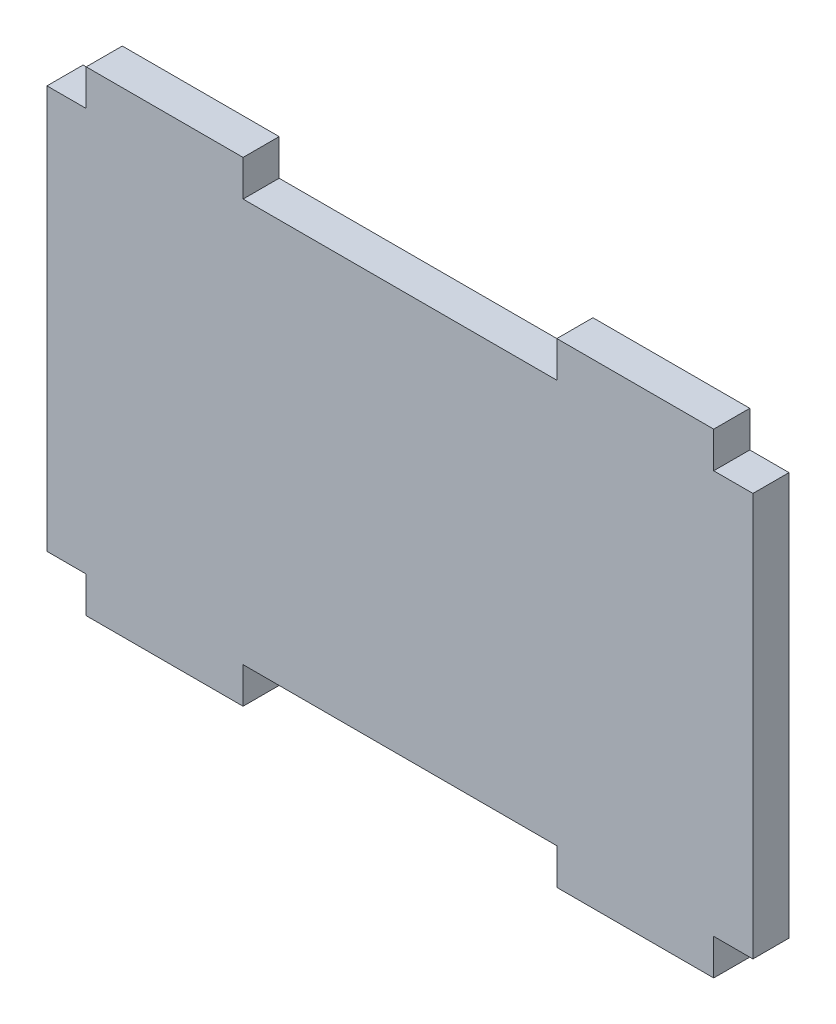
ISO-10303-21;
HEADER;
FILE_DESCRIPTION(('STEP AP214'),'2;1');
FILE_NAME('part.step','',(''),(''),'','','');
FILE_SCHEMA(('AUTOMOTIVE_DESIGN { 1 0 10303 214 1 1 1 1 }'));
ENDSEC;
DATA;
#1=APPLICATION_CONTEXT('core data for automotive mechanical design processes');
#2=APPLICATION_PROTOCOL_DEFINITION('international standard','automotive_design',2000,#1);
#3=PRODUCT_CONTEXT('',#1,'mechanical');
#4=PRODUCT('Part','Part','',(#3));
#5=PRODUCT_RELATED_PRODUCT_CATEGORY('part','',(#4));
#6=PRODUCT_DEFINITION_FORMATION('','',#4);
#7=PRODUCT_DEFINITION_CONTEXT('part definition',#1,'design');
#8=PRODUCT_DEFINITION('design','',#6,#7);
#9=PRODUCT_DEFINITION_SHAPE('','',#8);
#10=(LENGTH_UNIT() NAMED_UNIT(*) SI_UNIT(.MILLI.,.METRE.));
#11=(NAMED_UNIT(*) PLANE_ANGLE_UNIT() SI_UNIT($,.RADIAN.));
#12=(NAMED_UNIT(*) SI_UNIT($,.STERADIAN.) SOLID_ANGLE_UNIT());
#13=UNCERTAINTY_MEASURE_WITH_UNIT(LENGTH_MEASURE(1.E-05),#10,'distance_accuracy_value','');
#14=(GEOMETRIC_REPRESENTATION_CONTEXT(3) GLOBAL_UNCERTAINTY_ASSIGNED_CONTEXT((#13)) GLOBAL_UNIT_ASSIGNED_CONTEXT((#10,
#11,#12)) REPRESENTATION_CONTEXT('',''));
#15=CARTESIAN_POINT('',(0.,0.,0.));
#16=DIRECTION('',(0.,0.,1.));
#17=DIRECTION('',(1.,0.,0.));
#18=AXIS2_PLACEMENT_3D('',#15,#16,#17);
#19=CARTESIAN_POINT('',(2.5,2.3,0.6972));
#20=DIRECTION('',(0.,-1.,0.));
#21=DIRECTION('',(0.,0.,-1.));
#22=AXIS2_PLACEMENT_3D('',#19,#20,#21);
#23=PLANE('',#22);
#24=DIRECTION('',(1.,0.,0.));
#25=VECTOR('',#24,1.);
#26=CARTESIAN_POINT('',(2.5,2.3,2.9972));
#27=LINE('',#26,#25);
#28=CARTESIAN_POINT('',(0.,2.3,2.9972));
#29=VERTEX_POINT('',#28);
#30=CARTESIAN_POINT('',(2.5,2.3,2.9972));
#31=VERTEX_POINT('',#30);
#32=EDGE_CURVE('E202',#29,#31,#27,.T.);
#33=ORIENTED_EDGE('',*,*,#32,.F.);
#34=DIRECTION('',(0.,0.,1.));
#35=VECTOR('',#34,1.);
#36=CARTESIAN_POINT('',(0.,2.3,0.6972));
#37=LINE('',#36,#35);
#38=CARTESIAN_POINT('',(0.,2.3,0.6972));
#39=VERTEX_POINT('',#38);
#40=EDGE_CURVE('E11',#39,#29,#37,.T.);
#41=ORIENTED_EDGE('',*,*,#40,.F.);
#42=DIRECTION('',(1.,0.,0.));
#43=VECTOR('',#42,1.);
#44=CARTESIAN_POINT('',(2.5,2.3,0.6972));
#45=LINE('',#44,#43);
#46=CARTESIAN_POINT('',(2.5,2.3,0.6972));
#47=VERTEX_POINT('',#46);
#48=EDGE_CURVE('E258',#39,#47,#45,.T.);
#49=ORIENTED_EDGE('',*,*,#48,.T.);
#50=DIRECTION('',(0.,0.,1.));
#51=VECTOR('',#50,1.);
#52=CARTESIAN_POINT('',(2.5,2.3,0.6972));
#53=LINE('',#52,#51);
#54=EDGE_CURVE('E36',#47,#31,#53,.T.);
#55=ORIENTED_EDGE('',*,*,#54,.T.);
#56=EDGE_LOOP('',(#33,#41,#49,#55));
#57=FACE_BOUND('',#56,.T.);
#58=ADVANCED_FACE('F33',(#57),#23,.T.);
#59=CARTESIAN_POINT('',(0.,2.3,0.6972));
#60=DIRECTION('',(-1.,0.,0.));
#61=DIRECTION('',(0.,0.,1.));
#62=AXIS2_PLACEMENT_3D('',#59,#60,#61);
#63=PLANE('',#62);
#64=DIRECTION('',(0.,-1.,0.));
#65=VECTOR('',#64,1.);
#66=CARTESIAN_POINT('',(0.,2.3,2.9972));
#67=LINE('',#66,#65);
#68=CARTESIAN_POINT('',(0.,28.,2.9972));
#69=VERTEX_POINT('',#68);
#70=EDGE_CURVE('E256',#69,#29,#67,.T.);
#71=ORIENTED_EDGE('',*,*,#70,.F.);
#72=DIRECTION('',(0.,0.,1.));
#73=VECTOR('',#72,1.);
#74=CARTESIAN_POINT('',(0.,28.,0.6972));
#75=LINE('',#74,#73);
#76=CARTESIAN_POINT('',(0.,28.,0.6972));
#77=VERTEX_POINT('',#76);
#78=EDGE_CURVE('E42',#77,#69,#75,.T.);
#79=ORIENTED_EDGE('',*,*,#78,.F.);
#80=DIRECTION('',(0.,-1.,0.));
#81=VECTOR('',#80,1.);
#82=CARTESIAN_POINT('',(0.,2.3,0.6972));
#83=LINE('',#82,#81);
#84=EDGE_CURVE('E192',#77,#39,#83,.T.);
#85=ORIENTED_EDGE('',*,*,#84,.T.);
#86=ORIENTED_EDGE('',*,*,#40,.T.);
#87=EDGE_LOOP('',(#71,#79,#85,#86));
#88=FACE_BOUND('',#87,.T.);
#89=ADVANCED_FACE('F295',(#88),#63,.T.);
#90=CARTESIAN_POINT('',(0.,28.,0.6972));
#91=DIRECTION('',(0.,1.,0.));
#92=DIRECTION('',(0.,0.,1.));
#93=AXIS2_PLACEMENT_3D('',#90,#91,#92);
#94=PLANE('',#93);
#95=DIRECTION('',(-1.,0.,0.));
#96=VECTOR('',#95,1.);
#97=CARTESIAN_POINT('',(0.,28.,2.9972));
#98=LINE('',#97,#96);
#99=CARTESIAN_POINT('',(2.5,28.,2.9972));
#100=VERTEX_POINT('',#99);
#101=EDGE_CURVE('E179',#100,#69,#98,.T.);
#102=ORIENTED_EDGE('',*,*,#101,.F.);
#103=DIRECTION('',(0.,0.,1.));
#104=VECTOR('',#103,1.);
#105=CARTESIAN_POINT('',(2.5,28.,0.6972));
#106=LINE('',#105,#104);
#107=CARTESIAN_POINT('',(2.5,28.,0.6972));
#108=VERTEX_POINT('',#107);
#109=EDGE_CURVE('E174',#108,#100,#106,.T.);
#110=ORIENTED_EDGE('',*,*,#109,.F.);
#111=DIRECTION('',(-1.,0.,0.));
#112=VECTOR('',#111,1.);
#113=CARTESIAN_POINT('',(0.,28.,0.6972));
#114=LINE('',#113,#112);
#115=EDGE_CURVE('E177',#108,#77,#114,.T.);
#116=ORIENTED_EDGE('',*,*,#115,.T.);
#117=ORIENTED_EDGE('',*,*,#78,.T.);
#118=EDGE_LOOP('',(#102,#110,#116,#117));
#119=FACE_BOUND('',#118,.T.);
#120=ADVANCED_FACE('F176',(#119),#94,.T.);
#121=CARTESIAN_POINT('',(2.5,28.,0.6972));
#122=DIRECTION('',(-1.,0.,0.));
#123=DIRECTION('',(0.,-1.,0.));
#124=AXIS2_PLACEMENT_3D('',#121,#122,#123);
#125=PLANE('',#124);
#126=DIRECTION('',(0.,-1.,0.));
#127=VECTOR('',#126,1.);
#128=CARTESIAN_POINT('',(2.5,28.,2.9972));
#129=LINE('',#128,#127);
#130=CARTESIAN_POINT('',(2.5,30.3,2.9972));
#131=VERTEX_POINT('',#130);
#132=EDGE_CURVE('E253',#131,#100,#129,.T.);
#133=ORIENTED_EDGE('',*,*,#132,.F.);
#134=DIRECTION('',(0.,0.,1.));
#135=VECTOR('',#134,1.);
#136=CARTESIAN_POINT('',(2.5,30.3,0.6972));
#137=LINE('',#136,#135);
#138=CARTESIAN_POINT('',(2.5,30.3,0.6972));
#139=VERTEX_POINT('',#138);
#140=EDGE_CURVE('E184',#139,#131,#137,.T.);
#141=ORIENTED_EDGE('',*,*,#140,.F.);
#142=DIRECTION('',(0.,-1.,0.));
#143=VECTOR('',#142,1.);
#144=CARTESIAN_POINT('',(2.5,28.,0.6972));
#145=LINE('',#144,#143);
#146=EDGE_CURVE('E190',#139,#108,#145,.T.);
#147=ORIENTED_EDGE('',*,*,#146,.T.);
#148=ORIENTED_EDGE('',*,*,#109,.T.);
#149=EDGE_LOOP('',(#133,#141,#147,#148));
#150=FACE_BOUND('',#149,.T.);
#151=ADVANCED_FACE('F194',(#150),#125,.T.);
#152=CARTESIAN_POINT('',(2.5,30.3,0.6972));
#153=DIRECTION('',(0.,1.,0.));
#154=DIRECTION('',(-1.,0.,0.));
#155=AXIS2_PLACEMENT_3D('',#152,#153,#154);
#156=PLANE('',#155);
#157=DIRECTION('',(-1.,0.,0.));
#158=VECTOR('',#157,1.);
#159=CARTESIAN_POINT('',(2.5,30.3,2.9972));
#160=LINE('',#159,#158);
#161=CARTESIAN_POINT('',(12.5,30.3,2.9972));
#162=VERTEX_POINT('',#161);
#163=EDGE_CURVE('E250',#162,#131,#160,.T.);
#164=ORIENTED_EDGE('',*,*,#163,.F.);
#165=DIRECTION('',(0.,0.,1.));
#166=VECTOR('',#165,1.);
#167=CARTESIAN_POINT('',(12.5,30.3,0.6972));
#168=LINE('',#167,#166);
#169=CARTESIAN_POINT('',(12.5,30.3,0.6972));
#170=VERTEX_POINT('',#169);
#171=EDGE_CURVE('E262',#170,#162,#168,.T.);
#172=ORIENTED_EDGE('',*,*,#171,.F.);
#173=DIRECTION('',(-1.,0.,0.));
#174=VECTOR('',#173,1.);
#175=CARTESIAN_POINT('',(2.5,30.3,0.6972));
#176=LINE('',#175,#174);
#177=EDGE_CURVE('E195',#170,#139,#176,.T.);
#178=ORIENTED_EDGE('',*,*,#177,.T.);
#179=ORIENTED_EDGE('',*,*,#140,.T.);
#180=EDGE_LOOP('',(#164,#172,#178,#179));
#181=FACE_BOUND('',#180,.T.);
#182=ADVANCED_FACE('F308',(#181),#156,.T.);
#183=CARTESIAN_POINT('',(12.5,30.3,0.6972));
#184=DIRECTION('',(1.,0.,0.));
#185=DIRECTION('',(0.,1.,0.));
#186=AXIS2_PLACEMENT_3D('',#183,#184,#185);
#187=PLANE('',#186);
#188=DIRECTION('',(0.,1.,0.));
#189=VECTOR('',#188,1.);
#190=CARTESIAN_POINT('',(12.5,30.3,2.9972));
#191=LINE('',#190,#189);
#192=CARTESIAN_POINT('',(12.5,28.,2.9972));
#193=VERTEX_POINT('',#192);
#194=EDGE_CURVE('E247',#193,#162,#191,.T.);
#195=ORIENTED_EDGE('',*,*,#194,.F.);
#196=DIRECTION('',(0.,0.,1.));
#197=VECTOR('',#196,1.);
#198=CARTESIAN_POINT('',(12.5,28.,0.6972));
#199=LINE('',#198,#197);
#200=CARTESIAN_POINT('',(12.5,28.,0.6972));
#201=VERTEX_POINT('',#200);
#202=EDGE_CURVE('E264',#201,#193,#199,.T.);
#203=ORIENTED_EDGE('',*,*,#202,.F.);
#204=DIRECTION('',(0.,1.,0.));
#205=VECTOR('',#204,1.);
#206=CARTESIAN_POINT('',(12.5,30.3,0.6972));
#207=LINE('',#206,#205);
#208=EDGE_CURVE('E197',#201,#170,#207,.T.);
#209=ORIENTED_EDGE('',*,*,#208,.T.);
#210=ORIENTED_EDGE('',*,*,#171,.T.);
#211=EDGE_LOOP('',(#195,#203,#209,#210));
#212=FACE_BOUND('',#211,.T.);
#213=ADVANCED_FACE('F311',(#212),#187,.T.);
#214=CARTESIAN_POINT('',(12.5,28.,0.6972));
#215=DIRECTION('',(0.,1.,0.));
#216=DIRECTION('',(0.,0.,1.));
#217=AXIS2_PLACEMENT_3D('',#214,#215,#216);
#218=PLANE('',#217);
#219=DIRECTION('',(-1.,0.,0.));
#220=VECTOR('',#219,1.);
#221=CARTESIAN_POINT('',(12.5,28.,2.9972));
#222=LINE('',#221,#220);
#223=CARTESIAN_POINT('',(32.5,28.,2.9972));
#224=VERTEX_POINT('',#223);
#225=EDGE_CURVE('E244',#224,#193,#222,.T.);
#226=ORIENTED_EDGE('',*,*,#225,.F.);
#227=DIRECTION('',(0.,0.,1.));
#228=VECTOR('',#227,1.);
#229=CARTESIAN_POINT('',(32.5,28.,0.6972));
#230=LINE('',#229,#228);
#231=CARTESIAN_POINT('',(32.5,28.,0.6972));
#232=VERTEX_POINT('',#231);
#233=EDGE_CURVE('E266',#232,#224,#230,.T.);
#234=ORIENTED_EDGE('',*,*,#233,.F.);
#235=DIRECTION('',(-1.,0.,0.));
#236=VECTOR('',#235,1.);
#237=CARTESIAN_POINT('',(12.5,28.,0.6972));
#238=LINE('',#237,#236);
#239=EDGE_CURVE('E546',#232,#201,#238,.T.);
#240=ORIENTED_EDGE('',*,*,#239,.T.);
#241=ORIENTED_EDGE('',*,*,#202,.T.);
#242=EDGE_LOOP('',(#226,#234,#240,#241));
#243=FACE_BOUND('',#242,.T.);
#244=ADVANCED_FACE('F315',(#243),#218,.T.);
#245=CARTESIAN_POINT('',(32.5,28.,0.6972));
#246=DIRECTION('',(-1.,0.,0.));
#247=DIRECTION('',(0.,-1.,0.));
#248=AXIS2_PLACEMENT_3D('',#245,#246,#247);
#249=PLANE('',#248);
#250=DIRECTION('',(0.,-1.,0.));
#251=VECTOR('',#250,1.);
#252=CARTESIAN_POINT('',(32.5,28.,2.9972));
#253=LINE('',#252,#251);
#254=CARTESIAN_POINT('',(32.5,30.3,2.9972));
#255=VERTEX_POINT('',#254);
#256=EDGE_CURVE('E241',#255,#224,#253,.T.);
#257=ORIENTED_EDGE('',*,*,#256,.F.);
#258=DIRECTION('',(0.,0.,1.));
#259=VECTOR('',#258,1.);
#260=CARTESIAN_POINT('',(32.5,30.3,0.6972));
#261=LINE('',#260,#259);
#262=CARTESIAN_POINT('',(32.5,30.3,0.6972));
#263=VERTEX_POINT('',#262);
#264=EDGE_CURVE('E268',#263,#255,#261,.T.);
#265=ORIENTED_EDGE('',*,*,#264,.F.);
#266=DIRECTION('',(0.,-1.,0.));
#267=VECTOR('',#266,1.);
#268=CARTESIAN_POINT('',(32.5,28.,0.6972));
#269=LINE('',#268,#267);
#270=EDGE_CURVE('E543',#263,#232,#269,.T.);
#271=ORIENTED_EDGE('',*,*,#270,.T.);
#272=ORIENTED_EDGE('',*,*,#233,.T.);
#273=EDGE_LOOP('',(#257,#265,#271,#272));
#274=FACE_BOUND('',#273,.T.);
#275=ADVANCED_FACE('F319',(#274),#249,.T.);
#276=CARTESIAN_POINT('',(32.5,30.3,0.6972));
#277=DIRECTION('',(0.,1.,0.));
#278=DIRECTION('',(-1.,0.,0.));
#279=AXIS2_PLACEMENT_3D('',#276,#277,#278);
#280=PLANE('',#279);
#281=DIRECTION('',(-1.,0.,0.));
#282=VECTOR('',#281,1.);
#283=CARTESIAN_POINT('',(32.5,30.3,2.9972));
#284=LINE('',#283,#282);
#285=CARTESIAN_POINT('',(42.5,30.3,2.9972));
#286=VERTEX_POINT('',#285);
#287=EDGE_CURVE('E238',#286,#255,#284,.T.);
#288=ORIENTED_EDGE('',*,*,#287,.F.);
#289=DIRECTION('',(0.,0.,1.));
#290=VECTOR('',#289,1.);
#291=CARTESIAN_POINT('',(42.5,30.3,0.6972));
#292=LINE('',#291,#290);
#293=CARTESIAN_POINT('',(42.5,30.3,0.6972));
#294=VERTEX_POINT('',#293);
#295=EDGE_CURVE('E270',#294,#286,#292,.T.);
#296=ORIENTED_EDGE('',*,*,#295,.F.);
#297=DIRECTION('',(-1.,0.,0.));
#298=VECTOR('',#297,1.);
#299=CARTESIAN_POINT('',(32.5,30.3,0.6972));
#300=LINE('',#299,#298);
#301=EDGE_CURVE('E540',#294,#263,#300,.T.);
#302=ORIENTED_EDGE('',*,*,#301,.T.);
#303=ORIENTED_EDGE('',*,*,#264,.T.);
#304=EDGE_LOOP('',(#288,#296,#302,#303));
#305=FACE_BOUND('',#304,.T.);
#306=ADVANCED_FACE('F323',(#305),#280,.T.);
#307=CARTESIAN_POINT('',(42.5,30.3,0.6972));
#308=DIRECTION('',(1.,0.,0.));
#309=DIRECTION('',(0.,1.,0.));
#310=AXIS2_PLACEMENT_3D('',#307,#308,#309);
#311=PLANE('',#310);
#312=DIRECTION('',(0.,1.,0.));
#313=VECTOR('',#312,1.);
#314=CARTESIAN_POINT('',(42.5,30.3,2.9972));
#315=LINE('',#314,#313);
#316=CARTESIAN_POINT('',(42.5,28.,2.9972));
#317=VERTEX_POINT('',#316);
#318=EDGE_CURVE('E235',#317,#286,#315,.T.);
#319=ORIENTED_EDGE('',*,*,#318,.F.);
#320=DIRECTION('',(0.,0.,1.));
#321=VECTOR('',#320,1.);
#322=CARTESIAN_POINT('',(42.5,28.,0.6972));
#323=LINE('',#322,#321);
#324=CARTESIAN_POINT('',(42.5,28.,0.6972));
#325=VERTEX_POINT('',#324);
#326=EDGE_CURVE('E272',#325,#317,#323,.T.);
#327=ORIENTED_EDGE('',*,*,#326,.F.);
#328=DIRECTION('',(0.,1.,0.));
#329=VECTOR('',#328,1.);
#330=CARTESIAN_POINT('',(42.5,30.3,0.6972));
#331=LINE('',#330,#329);
#332=EDGE_CURVE('E537',#325,#294,#331,.T.);
#333=ORIENTED_EDGE('',*,*,#332,.T.);
#334=ORIENTED_EDGE('',*,*,#295,.T.);
#335=EDGE_LOOP('',(#319,#327,#333,#334));
#336=FACE_BOUND('',#335,.T.);
#337=ADVANCED_FACE('F327',(#336),#311,.T.);
#338=CARTESIAN_POINT('',(42.5,28.,0.6972));
#339=DIRECTION('',(0.,1.,0.));
#340=DIRECTION('',(0.,0.,1.));
#341=AXIS2_PLACEMENT_3D('',#338,#339,#340);
#342=PLANE('',#341);
#343=DIRECTION('',(-1.,0.,0.));
#344=VECTOR('',#343,1.);
#345=CARTESIAN_POINT('',(42.5,28.,2.9972));
#346=LINE('',#345,#344);
#347=CARTESIAN_POINT('',(45.,28.,2.9972));
#348=VERTEX_POINT('',#347);
#349=EDGE_CURVE('E232',#348,#317,#346,.T.);
#350=ORIENTED_EDGE('',*,*,#349,.F.);
#351=DIRECTION('',(0.,0.,1.));
#352=VECTOR('',#351,1.);
#353=CARTESIAN_POINT('',(45.,28.,0.6972));
#354=LINE('',#353,#352);
#355=CARTESIAN_POINT('',(45.,28.,0.6972));
#356=VERTEX_POINT('',#355);
#357=EDGE_CURVE('E274',#356,#348,#354,.T.);
#358=ORIENTED_EDGE('',*,*,#357,.F.);
#359=DIRECTION('',(-1.,0.,0.));
#360=VECTOR('',#359,1.);
#361=CARTESIAN_POINT('',(42.5,28.,0.6972));
#362=LINE('',#361,#360);
#363=EDGE_CURVE('E534',#356,#325,#362,.T.);
#364=ORIENTED_EDGE('',*,*,#363,.T.);
#365=ORIENTED_EDGE('',*,*,#326,.T.);
#366=EDGE_LOOP('',(#350,#358,#364,#365));
#367=FACE_BOUND('',#366,.T.);
#368=ADVANCED_FACE('F331',(#367),#342,.T.);
#369=CARTESIAN_POINT('',(45.,2.3,0.6972));
#370=DIRECTION('',(1.,0.,0.));
#371=DIRECTION('',(0.,0.,-1.));
#372=AXIS2_PLACEMENT_3D('',#369,#370,#371);
#373=PLANE('',#372);
#374=DIRECTION('',(0.,1.,0.));
#375=VECTOR('',#374,1.);
#376=CARTESIAN_POINT('',(45.,2.3,2.9972));
#377=LINE('',#376,#375);
#378=CARTESIAN_POINT('',(45.,2.3,2.9972));
#379=VERTEX_POINT('',#378);
#380=EDGE_CURVE('E229',#379,#348,#377,.T.);
#381=ORIENTED_EDGE('',*,*,#380,.F.);
#382=DIRECTION('',(0.,0.,1.));
#383=VECTOR('',#382,1.);
#384=CARTESIAN_POINT('',(45.,2.3,0.6972));
#385=LINE('',#384,#383);
#386=CARTESIAN_POINT('',(45.,2.3,0.6972));
#387=VERTEX_POINT('',#386);
#388=EDGE_CURVE('E276',#387,#379,#385,.T.);
#389=ORIENTED_EDGE('',*,*,#388,.F.);
#390=DIRECTION('',(0.,1.,0.));
#391=VECTOR('',#390,1.);
#392=CARTESIAN_POINT('',(45.,2.3,0.6972));
#393=LINE('',#392,#391);
#394=EDGE_CURVE('E531',#387,#356,#393,.T.);
#395=ORIENTED_EDGE('',*,*,#394,.T.);
#396=ORIENTED_EDGE('',*,*,#357,.T.);
#397=EDGE_LOOP('',(#381,#389,#395,#396));
#398=FACE_BOUND('',#397,.T.);
#399=ADVANCED_FACE('F335',(#398),#373,.T.);
#400=CARTESIAN_POINT('',(42.5,2.3,0.6972));
#401=DIRECTION('',(0.,-1.,0.));
#402=DIRECTION('',(0.,0.,-1.));
#403=AXIS2_PLACEMENT_3D('',#400,#401,#402);
#404=PLANE('',#403);
#405=DIRECTION('',(1.,0.,0.));
#406=VECTOR('',#405,1.);
#407=CARTESIAN_POINT('',(42.5,2.3,2.9972));
#408=LINE('',#407,#406);
#409=CARTESIAN_POINT('',(42.5,2.3,2.9972));
#410=VERTEX_POINT('',#409);
#411=EDGE_CURVE('E226',#410,#379,#408,.T.);
#412=ORIENTED_EDGE('',*,*,#411,.F.);
#413=DIRECTION('',(0.,0.,1.));
#414=VECTOR('',#413,1.);
#415=CARTESIAN_POINT('',(42.5,2.3,0.6972));
#416=LINE('',#415,#414);
#417=CARTESIAN_POINT('',(42.5,2.3,0.6972));
#418=VERTEX_POINT('',#417);
#419=EDGE_CURVE('E278',#418,#410,#416,.T.);
#420=ORIENTED_EDGE('',*,*,#419,.F.);
#421=DIRECTION('',(1.,0.,0.));
#422=VECTOR('',#421,1.);
#423=CARTESIAN_POINT('',(42.5,2.3,0.6972));
#424=LINE('',#423,#422);
#425=EDGE_CURVE('E528',#418,#387,#424,.T.);
#426=ORIENTED_EDGE('',*,*,#425,.T.);
#427=ORIENTED_EDGE('',*,*,#388,.T.);
#428=EDGE_LOOP('',(#412,#420,#426,#427));
#429=FACE_BOUND('',#428,.T.);
#430=ADVANCED_FACE('F339',(#429),#404,.T.);
#431=CARTESIAN_POINT('',(42.5,0.,0.6972));
#432=DIRECTION('',(1.,0.,0.));
#433=DIRECTION('',(0.,1.,0.));
#434=AXIS2_PLACEMENT_3D('',#431,#432,#433);
#435=PLANE('',#434);
#436=DIRECTION('',(0.,1.,0.));
#437=VECTOR('',#436,1.);
#438=CARTESIAN_POINT('',(42.5,0.,2.9972));
#439=LINE('',#438,#437);
#440=CARTESIAN_POINT('',(42.5,0.,2.9972));
#441=VERTEX_POINT('',#440);
#442=EDGE_CURVE('E223',#441,#410,#439,.T.);
#443=ORIENTED_EDGE('',*,*,#442,.F.);
#444=DIRECTION('',(0.,0.,1.));
#445=VECTOR('',#444,1.);
#446=CARTESIAN_POINT('',(42.5,0.,0.6972));
#447=LINE('',#446,#445);
#448=CARTESIAN_POINT('',(42.5,0.,0.6972));
#449=VERTEX_POINT('',#448);
#450=EDGE_CURVE('E280',#449,#441,#447,.T.);
#451=ORIENTED_EDGE('',*,*,#450,.F.);
#452=DIRECTION('',(0.,1.,0.));
#453=VECTOR('',#452,1.);
#454=CARTESIAN_POINT('',(42.5,0.,0.6972));
#455=LINE('',#454,#453);
#456=EDGE_CURVE('E525',#449,#418,#455,.T.);
#457=ORIENTED_EDGE('',*,*,#456,.T.);
#458=ORIENTED_EDGE('',*,*,#419,.T.);
#459=EDGE_LOOP('',(#443,#451,#457,#458));
#460=FACE_BOUND('',#459,.T.);
#461=ADVANCED_FACE('F343',(#460),#435,.T.);
#462=CARTESIAN_POINT('',(32.5,0.,0.6972));
#463=DIRECTION('',(0.,-1.,0.));
#464=DIRECTION('',(1.,0.,0.));
#465=AXIS2_PLACEMENT_3D('',#462,#463,#464);
#466=PLANE('',#465);
#467=DIRECTION('',(1.,0.,0.));
#468=VECTOR('',#467,1.);
#469=CARTESIAN_POINT('',(32.5,0.,2.9972));
#470=LINE('',#469,#468);
#471=CARTESIAN_POINT('',(32.5,0.,2.9972));
#472=VERTEX_POINT('',#471);
#473=EDGE_CURVE('E220',#472,#441,#470,.T.);
#474=ORIENTED_EDGE('',*,*,#473,.F.);
#475=DIRECTION('',(0.,0.,1.));
#476=VECTOR('',#475,1.);
#477=CARTESIAN_POINT('',(32.5,0.,0.6972));
#478=LINE('',#477,#476);
#479=CARTESIAN_POINT('',(32.5,0.,0.6972));
#480=VERTEX_POINT('',#479);
#481=EDGE_CURVE('E282',#480,#472,#478,.T.);
#482=ORIENTED_EDGE('',*,*,#481,.F.);
#483=DIRECTION('',(1.,0.,0.));
#484=VECTOR('',#483,1.);
#485=CARTESIAN_POINT('',(32.5,0.,0.6972));
#486=LINE('',#485,#484);
#487=EDGE_CURVE('E517',#480,#449,#486,.T.);
#488=ORIENTED_EDGE('',*,*,#487,.T.);
#489=ORIENTED_EDGE('',*,*,#450,.T.);
#490=EDGE_LOOP('',(#474,#482,#488,#489));
#491=FACE_BOUND('',#490,.T.);
#492=ADVANCED_FACE('F347',(#491),#466,.T.);
#493=CARTESIAN_POINT('',(32.5,2.3,0.6972));
#494=DIRECTION('',(-1.,0.,0.));
#495=DIRECTION('',(0.,-1.,0.));
#496=AXIS2_PLACEMENT_3D('',#493,#494,#495);
#497=PLANE('',#496);
#498=DIRECTION('',(0.,-1.,0.));
#499=VECTOR('',#498,1.);
#500=CARTESIAN_POINT('',(32.5,2.3,2.9972));
#501=LINE('',#500,#499);
#502=CARTESIAN_POINT('',(32.5,2.3,2.9972));
#503=VERTEX_POINT('',#502);
#504=EDGE_CURVE('E217',#503,#472,#501,.T.);
#505=ORIENTED_EDGE('',*,*,#504,.F.);
#506=DIRECTION('',(0.,0.,1.));
#507=VECTOR('',#506,1.);
#508=CARTESIAN_POINT('',(32.5,2.3,0.6972));
#509=LINE('',#508,#507);
#510=CARTESIAN_POINT('',(32.5,2.3,0.6972));
#511=VERTEX_POINT('',#510);
#512=EDGE_CURVE('E284',#511,#503,#509,.T.);
#513=ORIENTED_EDGE('',*,*,#512,.F.);
#514=DIRECTION('',(0.,-1.,0.));
#515=VECTOR('',#514,1.);
#516=CARTESIAN_POINT('',(32.5,2.3,0.6972));
#517=LINE('',#516,#515);
#518=EDGE_CURVE('E515',#511,#480,#517,.T.);
#519=ORIENTED_EDGE('',*,*,#518,.T.);
#520=ORIENTED_EDGE('',*,*,#481,.T.);
#521=EDGE_LOOP('',(#505,#513,#519,#520));
#522=FACE_BOUND('',#521,.T.);
#523=ADVANCED_FACE('F351',(#522),#497,.T.);
#524=CARTESIAN_POINT('',(22.5,2.3,0.6972));
#525=DIRECTION('',(0.,-1.,0.));
#526=DIRECTION('',(1.,0.,0.));
#527=AXIS2_PLACEMENT_3D('',#524,#525,#526);
#528=PLANE('',#527);
#529=DIRECTION('',(1.,0.,0.));
#530=VECTOR('',#529,1.);
#531=CARTESIAN_POINT('',(22.5,2.3,2.9972));
#532=LINE('',#531,#530);
#533=CARTESIAN_POINT('',(12.5,2.3,2.9972));
#534=VERTEX_POINT('',#533);
#535=EDGE_CURVE('E214',#534,#503,#532,.T.);
#536=ORIENTED_EDGE('',*,*,#535,.F.);
#537=DIRECTION('',(0.,0.,1.));
#538=VECTOR('',#537,1.);
#539=CARTESIAN_POINT('',(12.5,2.3,0.6972));
#540=LINE('',#539,#538);
#541=CARTESIAN_POINT('',(12.5,2.3,0.6972));
#542=VERTEX_POINT('',#541);
#543=EDGE_CURVE('E286',#542,#534,#540,.T.);
#544=ORIENTED_EDGE('',*,*,#543,.F.);
#545=DIRECTION('',(1.,0.,0.));
#546=VECTOR('',#545,1.);
#547=CARTESIAN_POINT('',(22.5,2.3,0.6972));
#548=LINE('',#547,#546);
#549=EDGE_CURVE('E510',#542,#511,#548,.T.);
#550=ORIENTED_EDGE('',*,*,#549,.T.);
#551=ORIENTED_EDGE('',*,*,#512,.T.);
#552=EDGE_LOOP('',(#536,#544,#550,#551));
#553=FACE_BOUND('',#552,.T.);
#554=ADVANCED_FACE('F355',(#553),#528,.T.);
#555=CARTESIAN_POINT('',(12.5,2.3,0.6972));
#556=DIRECTION('',(1.,0.,0.));
#557=DIRECTION('',(0.,1.,0.));
#558=AXIS2_PLACEMENT_3D('',#555,#556,#557);
#559=PLANE('',#558);
#560=DIRECTION('',(0.,1.,0.));
#561=VECTOR('',#560,1.);
#562=CARTESIAN_POINT('',(12.5,2.3,2.9972));
#563=LINE('',#562,#561);
#564=CARTESIAN_POINT('',(12.5,0.,2.9972));
#565=VERTEX_POINT('',#564);
#566=EDGE_CURVE('E211',#565,#534,#563,.T.);
#567=ORIENTED_EDGE('',*,*,#566,.F.);
#568=DIRECTION('',(0.,0.,1.));
#569=VECTOR('',#568,1.);
#570=CARTESIAN_POINT('',(12.5,0.,0.6972));
#571=LINE('',#570,#569);
#572=CARTESIAN_POINT('',(12.5,0.,0.6972));
#573=VERTEX_POINT('',#572);
#574=EDGE_CURVE('E289',#573,#565,#571,.T.);
#575=ORIENTED_EDGE('',*,*,#574,.F.);
#576=DIRECTION('',(0.,1.,0.));
#577=VECTOR('',#576,1.);
#578=CARTESIAN_POINT('',(12.5,2.3,0.6972));
#579=LINE('',#578,#577);
#580=EDGE_CURVE('E508',#573,#542,#579,.T.);
#581=ORIENTED_EDGE('',*,*,#580,.T.);
#582=ORIENTED_EDGE('',*,*,#543,.T.);
#583=EDGE_LOOP('',(#567,#575,#581,#582));
#584=FACE_BOUND('',#583,.T.);
#585=ADVANCED_FACE('F359',(#584),#559,.T.);
#586=CARTESIAN_POINT('',(12.5,0.,0.6972));
#587=DIRECTION('',(0.,-1.,0.));
#588=DIRECTION('',(1.,0.,0.));
#589=AXIS2_PLACEMENT_3D('',#586,#587,#588);
#590=PLANE('',#589);
#591=DIRECTION('',(1.,0.,0.));
#592=VECTOR('',#591,1.);
#593=CARTESIAN_POINT('',(12.5,0.,2.9972));
#594=LINE('',#593,#592);
#595=CARTESIAN_POINT('',(2.5,0.,2.9972));
#596=VERTEX_POINT('',#595);
#597=EDGE_CURVE('E208',#596,#565,#594,.T.);
#598=ORIENTED_EDGE('',*,*,#597,.F.);
#599=DIRECTION('',(0.,0.,1.));
#600=VECTOR('',#599,1.);
#601=CARTESIAN_POINT('',(2.5,0.,0.6972));
#602=LINE('',#601,#600);
#603=CARTESIAN_POINT('',(2.5,0.,0.6972));
#604=VERTEX_POINT('',#603);
#605=EDGE_CURVE('E290',#604,#596,#602,.T.);
#606=ORIENTED_EDGE('',*,*,#605,.F.);
#607=DIRECTION('',(1.,0.,0.));
#608=VECTOR('',#607,1.);
#609=CARTESIAN_POINT('',(12.5,0.,0.6972));
#610=LINE('',#609,#608);
#611=EDGE_CURVE('E519',#604,#573,#610,.T.);
#612=ORIENTED_EDGE('',*,*,#611,.T.);
#613=ORIENTED_EDGE('',*,*,#574,.T.);
#614=EDGE_LOOP('',(#598,#606,#612,#613));
#615=FACE_BOUND('',#614,.T.);
#616=ADVANCED_FACE('F363',(#615),#590,.T.);
#617=CARTESIAN_POINT('',(2.5,0.,0.6972));
#618=DIRECTION('',(-1.,0.,0.));
#619=DIRECTION('',(0.,-1.,0.));
#620=AXIS2_PLACEMENT_3D('',#617,#618,#619);
#621=PLANE('',#620);
#622=DIRECTION('',(0.,-1.,0.));
#623=VECTOR('',#622,1.);
#624=CARTESIAN_POINT('',(2.5,0.,2.9972));
#625=LINE('',#624,#623);
#626=EDGE_CURVE('E205',#31,#596,#625,.T.);
#627=ORIENTED_EDGE('',*,*,#626,.F.);
#628=ORIENTED_EDGE('',*,*,#54,.F.);
#629=DIRECTION('',(0.,-1.,0.));
#630=VECTOR('',#629,1.);
#631=CARTESIAN_POINT('',(2.5,0.,0.6972));
#632=LINE('',#631,#630);
#633=EDGE_CURVE('E571',#47,#604,#632,.T.);
#634=ORIENTED_EDGE('',*,*,#633,.T.);
#635=ORIENTED_EDGE('',*,*,#605,.T.);
#636=EDGE_LOOP('',(#627,#628,#634,#635));
#637=FACE_BOUND('',#636,.T.);
#638=ADVANCED_FACE('F292',(#637),#621,.T.);
#639=CARTESIAN_POINT('',(0.,0.,0.6972));
#640=DIRECTION('',(0.,0.,-1.));
#641=DIRECTION('',(-1.,0.,0.));
#642=AXIS2_PLACEMENT_3D('',#639,#640,#641);
#643=PLANE('',#642);
#644=ORIENTED_EDGE('',*,*,#48,.F.);
#645=ORIENTED_EDGE('',*,*,#84,.F.);
#646=ORIENTED_EDGE('',*,*,#115,.F.);
#647=ORIENTED_EDGE('',*,*,#146,.F.);
#648=ORIENTED_EDGE('',*,*,#177,.F.);
#649=ORIENTED_EDGE('',*,*,#208,.F.);
#650=ORIENTED_EDGE('',*,*,#239,.F.);
#651=ORIENTED_EDGE('',*,*,#270,.F.);
#652=ORIENTED_EDGE('',*,*,#301,.F.);
#653=ORIENTED_EDGE('',*,*,#332,.F.);
#654=ORIENTED_EDGE('',*,*,#363,.F.);
#655=ORIENTED_EDGE('',*,*,#394,.F.);
#656=ORIENTED_EDGE('',*,*,#425,.F.);
#657=ORIENTED_EDGE('',*,*,#456,.F.);
#658=ORIENTED_EDGE('',*,*,#487,.F.);
#659=ORIENTED_EDGE('',*,*,#518,.F.);
#660=ORIENTED_EDGE('',*,*,#549,.F.);
#661=ORIENTED_EDGE('',*,*,#580,.F.);
#662=ORIENTED_EDGE('',*,*,#611,.F.);
#663=ORIENTED_EDGE('',*,*,#633,.F.);
#664=EDGE_LOOP('',(#644,#645,#646,#647,#648,#649,#650,#651,#652,#653,#654,#655,#656,#657,#658,
#659,#660,#661,#662,#663));
#665=FACE_BOUND('',#664,.T.);
#666=ADVANCED_FACE('F188',(#665),#643,.T.);
#667=CARTESIAN_POINT('',(0.,0.,2.9972));
#668=DIRECTION('',(0.,0.,-1.));
#669=DIRECTION('',(-1.,0.,0.));
#670=AXIS2_PLACEMENT_3D('',#667,#668,#669);
#671=PLANE('',#670);
#672=ORIENTED_EDGE('',*,*,#32,.T.);
#673=ORIENTED_EDGE('',*,*,#626,.T.);
#674=ORIENTED_EDGE('',*,*,#597,.T.);
#675=ORIENTED_EDGE('',*,*,#566,.T.);
#676=ORIENTED_EDGE('',*,*,#535,.T.);
#677=ORIENTED_EDGE('',*,*,#504,.T.);
#678=ORIENTED_EDGE('',*,*,#473,.T.);
#679=ORIENTED_EDGE('',*,*,#442,.T.);
#680=ORIENTED_EDGE('',*,*,#411,.T.);
#681=ORIENTED_EDGE('',*,*,#380,.T.);
#682=ORIENTED_EDGE('',*,*,#349,.T.);
#683=ORIENTED_EDGE('',*,*,#318,.T.);
#684=ORIENTED_EDGE('',*,*,#287,.T.);
#685=ORIENTED_EDGE('',*,*,#256,.T.);
#686=ORIENTED_EDGE('',*,*,#225,.T.);
#687=ORIENTED_EDGE('',*,*,#194,.T.);
#688=ORIENTED_EDGE('',*,*,#163,.T.);
#689=ORIENTED_EDGE('',*,*,#132,.T.);
#690=ORIENTED_EDGE('',*,*,#101,.T.);
#691=ORIENTED_EDGE('',*,*,#70,.T.);
#692=EDGE_LOOP('',(#672,#673,#674,#675,#676,#677,#678,#679,#680,#681,#682,#683,#684,#685,#686,
#687,#688,#689,#690,#691));
#693=FACE_BOUND('',#692,.T.);
#694=ADVANCED_FACE('F294',(#693),#671,.F.);
#695=CLOSED_SHELL('',(#58,#89,#120,#151,#182,#213,#244,#275,#306,#337,#368,#399,#430,#461,#492,
#523,#554,#585,#616,#638,#666,#694));
#696=MANIFOLD_SOLID_BREP('B2',#695);
#697=ADVANCED_BREP_SHAPE_REPRESENTATION('',(#18,#696),#14);
#698=SHAPE_DEFINITION_REPRESENTATION(#9,#697);
ENDSEC;
END-ISO-10303-21;
